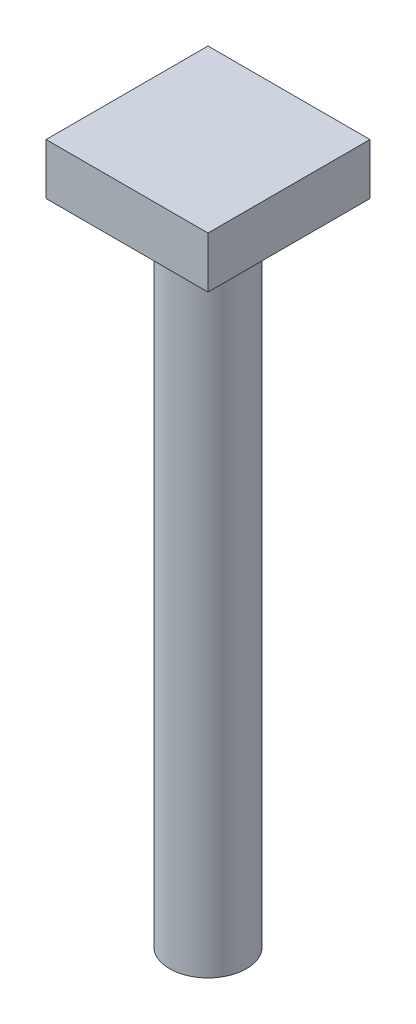
ISO-10303-21;
HEADER;
FILE_DESCRIPTION(('STEP AP214'),'2;1');
FILE_NAME('part.step','',(''),(''),'','','');
FILE_SCHEMA(('AUTOMOTIVE_DESIGN { 1 0 10303 214 1 1 1 1 }'));
ENDSEC;
DATA;
#1=APPLICATION_CONTEXT('core data for automotive mechanical design processes');
#2=APPLICATION_PROTOCOL_DEFINITION('international standard','automotive_design',2000,#1);
#3=PRODUCT_CONTEXT('',#1,'mechanical');
#4=PRODUCT('Part','Part','',(#3));
#5=PRODUCT_RELATED_PRODUCT_CATEGORY('part','',(#4));
#6=PRODUCT_DEFINITION_FORMATION('','',#4);
#7=PRODUCT_DEFINITION_CONTEXT('part definition',#1,'design');
#8=PRODUCT_DEFINITION('design','',#6,#7);
#9=PRODUCT_DEFINITION_SHAPE('','',#8);
#10=(LENGTH_UNIT() NAMED_UNIT(*) SI_UNIT(.MILLI.,.METRE.));
#11=(NAMED_UNIT(*) PLANE_ANGLE_UNIT() SI_UNIT($,.RADIAN.));
#12=(NAMED_UNIT(*) SI_UNIT($,.STERADIAN.) SOLID_ANGLE_UNIT());
#13=UNCERTAINTY_MEASURE_WITH_UNIT(LENGTH_MEASURE(1.E-05),#10,'distance_accuracy_value','');
#14=(GEOMETRIC_REPRESENTATION_CONTEXT(3) GLOBAL_UNCERTAINTY_ASSIGNED_CONTEXT((#13)) GLOBAL_UNIT_ASSIGNED_CONTEXT((#10,
#11,#12)) REPRESENTATION_CONTEXT('',''));
#15=CARTESIAN_POINT('',(0.,0.,0.));
#16=DIRECTION('',(0.,0.,1.));
#17=DIRECTION('',(1.,0.,0.));
#18=AXIS2_PLACEMENT_3D('',#15,#16,#17);
#19=CARTESIAN_POINT('',(0.,0.,0.));
#20=DIRECTION('',(0.,-1.,0.));
#21=DIRECTION('',(0.,0.,-1.));
#22=AXIS2_PLACEMENT_3D('',#19,#20,#21);
#23=PLANE('',#22);
#24=DIRECTION('',(0.,0.,1.));
#25=VECTOR('',#24,1.);
#26=CARTESIAN_POINT('',(-9.50000000000001,0.,-9.5));
#27=LINE('',#26,#25);
#28=CARTESIAN_POINT('',(-9.50000000000001,0.,-9.5));
#29=VERTEX_POINT('',#28);
#30=CARTESIAN_POINT('',(-9.5,0.,9.5));
#31=VERTEX_POINT('',#30);
#32=EDGE_CURVE('E97',#29,#31,#27,.T.);
#33=ORIENTED_EDGE('',*,*,#32,.F.);
#34=DIRECTION('',(-1.,0.,0.));
#35=VECTOR('',#34,1.);
#36=CARTESIAN_POINT('',(9.49999999999999,0.,-9.5));
#37=LINE('',#36,#35);
#38=CARTESIAN_POINT('',(9.49999999999999,0.,-9.5));
#39=VERTEX_POINT('',#38);
#40=EDGE_CURVE('E73',#39,#29,#37,.T.);
#41=ORIENTED_EDGE('',*,*,#40,.F.);
#42=DIRECTION('',(0.,0.,-1.));
#43=VECTOR('',#42,1.);
#44=CARTESIAN_POINT('',(9.49999999999999,0.,-9.5));
#45=LINE('',#44,#43);
#46=CARTESIAN_POINT('',(9.5,0.,9.5));
#47=VERTEX_POINT('',#46);
#48=EDGE_CURVE('E67',#47,#39,#45,.T.);
#49=ORIENTED_EDGE('',*,*,#48,.F.);
#50=DIRECTION('',(1.,0.,0.));
#51=VECTOR('',#50,1.);
#52=CARTESIAN_POINT('',(9.5,0.,9.5));
#53=LINE('',#52,#51);
#54=EDGE_CURVE('E89',#31,#47,#53,.T.);
#55=ORIENTED_EDGE('',*,*,#54,.F.);
#56=EDGE_LOOP('',(#33,#41,#49,#55));
#57=FACE_BOUND('',#56,.T.);
#58=CARTESIAN_POINT('',(0.,0.,0.));
#59=DIRECTION('',(0.,-1.,0.));
#60=DIRECTION('',(0.,0.,-1.));
#61=AXIS2_PLACEMENT_3D('',#58,#59,#60);
#62=CIRCLE('',#61,4.5);
#63=CARTESIAN_POINT('',(0.,0.,-4.5));
#64=VERTEX_POINT('',#63);
#65=EDGE_CURVE('E111',#64,#64,#62,.T.);
#66=ORIENTED_EDGE('',*,*,#65,.F.);
#67=EDGE_LOOP('',(#66));
#68=FACE_BOUND('',#67,.T.);
#69=ADVANCED_FACE('F33',(#57,#68),#23,.T.);
#70=CARTESIAN_POINT('',(-9.50000000000001,6.,-9.5));
#71=DIRECTION('',(1.,0.,0.));
#72=DIRECTION('',(0.,0.,-1.));
#73=AXIS2_PLACEMENT_3D('',#70,#71,#72);
#74=PLANE('',#73);
#75=ORIENTED_EDGE('',*,*,#32,.T.);
#76=DIRECTION('',(0.,-1.,0.));
#77=VECTOR('',#76,1.);
#78=CARTESIAN_POINT('',(-9.5,6.,9.5));
#79=LINE('',#78,#77);
#80=CARTESIAN_POINT('',(-9.5,6.,9.5));
#81=VERTEX_POINT('',#80);
#82=EDGE_CURVE('E11',#81,#31,#79,.T.);
#83=ORIENTED_EDGE('',*,*,#82,.F.);
#84=DIRECTION('',(0.,0.,1.));
#85=VECTOR('',#84,1.);
#86=CARTESIAN_POINT('',(-9.50000000000001,6.,-9.5));
#87=LINE('',#86,#85);
#88=CARTESIAN_POINT('',(-9.50000000000001,6.,-9.5));
#89=VERTEX_POINT('',#88);
#90=EDGE_CURVE('E85',#89,#81,#87,.T.);
#91=ORIENTED_EDGE('',*,*,#90,.F.);
#92=DIRECTION('',(0.,-1.,0.));
#93=VECTOR('',#92,1.);
#94=CARTESIAN_POINT('',(-9.50000000000001,6.,-9.5));
#95=LINE('',#94,#93);
#96=EDGE_CURVE('E93',#89,#29,#95,.T.);
#97=ORIENTED_EDGE('',*,*,#96,.T.);
#98=EDGE_LOOP('',(#75,#83,#91,#97));
#99=FACE_BOUND('',#98,.T.);
#100=ADVANCED_FACE('F35',(#99),#74,.F.);
#101=CARTESIAN_POINT('',(9.5,6.,9.5));
#102=DIRECTION('',(0.,0.,-1.));
#103=DIRECTION('',(-1.,0.,0.));
#104=AXIS2_PLACEMENT_3D('',#101,#102,#103);
#105=PLANE('',#104);
#106=ORIENTED_EDGE('',*,*,#54,.T.);
#107=DIRECTION('',(0.,-1.,0.));
#108=VECTOR('',#107,1.);
#109=CARTESIAN_POINT('',(9.5,6.,9.5));
#110=LINE('',#109,#108);
#111=CARTESIAN_POINT('',(9.5,6.,9.5));
#112=VERTEX_POINT('',#111);
#113=EDGE_CURVE('E42',#112,#47,#110,.T.);
#114=ORIENTED_EDGE('',*,*,#113,.F.);
#115=DIRECTION('',(1.,0.,0.));
#116=VECTOR('',#115,1.);
#117=CARTESIAN_POINT('',(9.5,6.,9.5));
#118=LINE('',#117,#116);
#119=EDGE_CURVE('E80',#81,#112,#118,.T.);
#120=ORIENTED_EDGE('',*,*,#119,.F.);
#121=ORIENTED_EDGE('',*,*,#82,.T.);
#122=EDGE_LOOP('',(#106,#114,#120,#121));
#123=FACE_BOUND('',#122,.T.);
#124=ADVANCED_FACE('F88',(#123),#105,.F.);
#125=CARTESIAN_POINT('',(9.49999999999999,6.,-9.5));
#126=DIRECTION('',(-1.,0.,0.));
#127=DIRECTION('',(0.,0.,1.));
#128=AXIS2_PLACEMENT_3D('',#125,#126,#127);
#129=PLANE('',#128);
#130=ORIENTED_EDGE('',*,*,#48,.T.);
#131=DIRECTION('',(0.,-1.,0.));
#132=VECTOR('',#131,1.);
#133=CARTESIAN_POINT('',(9.49999999999999,6.,-9.5));
#134=LINE('',#133,#132);
#135=CARTESIAN_POINT('',(9.49999999999999,6.,-9.5));
#136=VERTEX_POINT('',#135);
#137=EDGE_CURVE('E90',#136,#39,#134,.T.);
#138=ORIENTED_EDGE('',*,*,#137,.F.);
#139=DIRECTION('',(0.,0.,-1.));
#140=VECTOR('',#139,1.);
#141=CARTESIAN_POINT('',(9.49999999999999,6.,-9.5));
#142=LINE('',#141,#140);
#143=EDGE_CURVE('E83',#112,#136,#142,.T.);
#144=ORIENTED_EDGE('',*,*,#143,.F.);
#145=ORIENTED_EDGE('',*,*,#113,.T.);
#146=EDGE_LOOP('',(#130,#138,#144,#145));
#147=FACE_BOUND('',#146,.T.);
#148=ADVANCED_FACE('F91',(#147),#129,.F.);
#149=CARTESIAN_POINT('',(9.49999999999999,6.,-9.5));
#150=DIRECTION('',(0.,0.,1.));
#151=DIRECTION('',(1.,0.,0.));
#152=AXIS2_PLACEMENT_3D('',#149,#150,#151);
#153=PLANE('',#152);
#154=ORIENTED_EDGE('',*,*,#40,.T.);
#155=ORIENTED_EDGE('',*,*,#96,.F.);
#156=DIRECTION('',(-1.,0.,0.));
#157=VECTOR('',#156,1.);
#158=CARTESIAN_POINT('',(9.49999999999999,6.,-9.5));
#159=LINE('',#158,#157);
#160=EDGE_CURVE('E50',#136,#89,#159,.T.);
#161=ORIENTED_EDGE('',*,*,#160,.F.);
#162=ORIENTED_EDGE('',*,*,#137,.T.);
#163=EDGE_LOOP('',(#154,#155,#161,#162));
#164=FACE_BOUND('',#163,.T.);
#165=ADVANCED_FACE('F105',(#164),#153,.F.);
#166=CARTESIAN_POINT('',(0.,6.,0.));
#167=DIRECTION('',(0.,-1.,0.));
#168=DIRECTION('',(0.,0.,-1.));
#169=AXIS2_PLACEMENT_3D('',#166,#167,#168);
#170=PLANE('',#169);
#171=ORIENTED_EDGE('',*,*,#90,.T.);
#172=ORIENTED_EDGE('',*,*,#119,.T.);
#173=ORIENTED_EDGE('',*,*,#143,.T.);
#174=ORIENTED_EDGE('',*,*,#160,.T.);
#175=EDGE_LOOP('',(#171,#172,#173,#174));
#176=FACE_BOUND('',#175,.T.);
#177=ADVANCED_FACE('F81',(#176),#170,.F.);
#178=CARTESIAN_POINT('',(0.,-76.,0.));
#179=DIRECTION('',(0.,1.,0.));
#180=DIRECTION('',(0.,0.,1.));
#181=AXIS2_PLACEMENT_3D('',#178,#179,#180);
#182=CYLINDRICAL_SURFACE('',#181,4.5);
#183=CARTESIAN_POINT('',(0.,-76.,0.));
#184=DIRECTION('',(0.,-1.,0.));
#185=DIRECTION('',(0.,0.,-1.));
#186=AXIS2_PLACEMENT_3D('',#183,#184,#185);
#187=CIRCLE('',#186,4.5);
#188=CARTESIAN_POINT('',(0.,-76.,-4.5));
#189=VERTEX_POINT('',#188);
#190=EDGE_CURVE('E100',#189,#189,#187,.T.);
#191=ORIENTED_EDGE('',*,*,#190,.F.);
#192=EDGE_LOOP('',(#191));
#193=FACE_BOUND('',#192,.T.);
#194=ORIENTED_EDGE('',*,*,#65,.T.);
#195=EDGE_LOOP('',(#194));
#196=FACE_BOUND('',#195,.T.);
#197=ADVANCED_FACE('F119',(#193,#196),#182,.T.);
#198=CARTESIAN_POINT('',(0.,-76.,0.));
#199=DIRECTION('',(0.,-1.,0.));
#200=DIRECTION('',(0.,0.,-1.));
#201=AXIS2_PLACEMENT_3D('',#198,#199,#200);
#202=PLANE('',#201);
#203=ORIENTED_EDGE('',*,*,#190,.T.);
#204=EDGE_LOOP('',(#203));
#205=FACE_BOUND('',#204,.T.);
#206=ADVANCED_FACE('F117',(#205),#202,.T.);
#207=CLOSED_SHELL('',(#69,#100,#124,#148,#165,#177,#197,#206));
#208=MANIFOLD_SOLID_BREP('B2',#207);
#209=ADVANCED_BREP_SHAPE_REPRESENTATION('',(#18,#208),#14);
#210=SHAPE_DEFINITION_REPRESENTATION(#9,#209);
ENDSEC;
END-ISO-10303-21;
